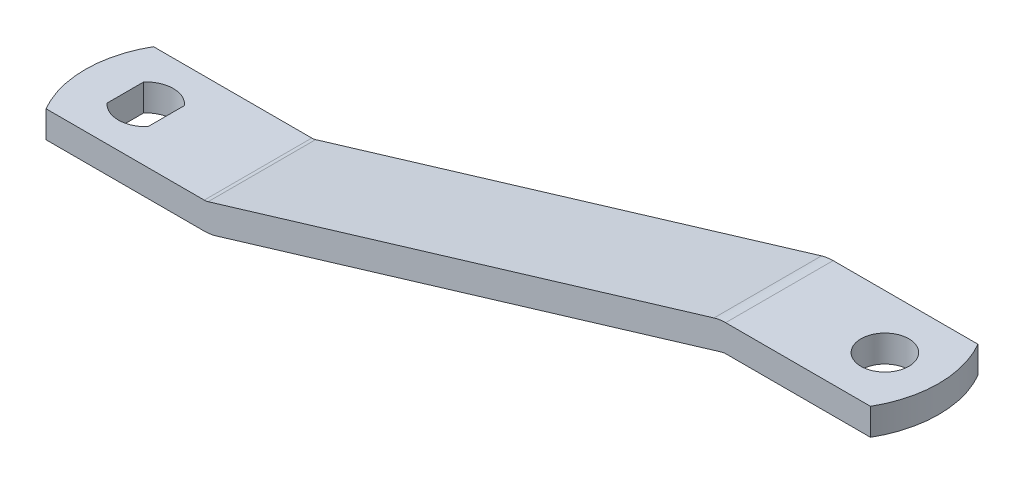
ISO-10303-21;
HEADER;
FILE_DESCRIPTION(('STEP AP214'),'2;1');
FILE_NAME('part.step','',(''),(''),'','','');
FILE_SCHEMA(('AUTOMOTIVE_DESIGN { 1 0 10303 214 1 1 1 1 }'));
ENDSEC;
DATA;
#1=APPLICATION_CONTEXT('core data for automotive mechanical design processes');
#2=APPLICATION_PROTOCOL_DEFINITION('international standard','automotive_design',2000,#1);
#3=PRODUCT_CONTEXT('',#1,'mechanical');
#4=PRODUCT('Part','Part','',(#3));
#5=PRODUCT_RELATED_PRODUCT_CATEGORY('part','',(#4));
#6=PRODUCT_DEFINITION_FORMATION('','',#4);
#7=PRODUCT_DEFINITION_CONTEXT('part definition',#1,'design');
#8=PRODUCT_DEFINITION('design','',#6,#7);
#9=PRODUCT_DEFINITION_SHAPE('','',#8);
#10=(LENGTH_UNIT() NAMED_UNIT(*) SI_UNIT(.MILLI.,.METRE.));
#11=(NAMED_UNIT(*) PLANE_ANGLE_UNIT() SI_UNIT($,.RADIAN.));
#12=(NAMED_UNIT(*) SI_UNIT($,.STERADIAN.) SOLID_ANGLE_UNIT());
#13=UNCERTAINTY_MEASURE_WITH_UNIT(LENGTH_MEASURE(1.E-05),#10,'distance_accuracy_value','');
#14=(GEOMETRIC_REPRESENTATION_CONTEXT(3) GLOBAL_UNCERTAINTY_ASSIGNED_CONTEXT((#13)) GLOBAL_UNIT_ASSIGNED_CONTEXT((#10,
#11,#12)) REPRESENTATION_CONTEXT('',''));
#15=CARTESIAN_POINT('',(0.,0.,0.));
#16=DIRECTION('',(0.,0.,1.));
#17=DIRECTION('',(1.,0.,0.));
#18=AXIS2_PLACEMENT_3D('',#15,#16,#17);
#19=CARTESIAN_POINT('',(163.979954734275,33.3375000000001,0.));
#20=DIRECTION('',(0.,0.,1.));
#21=DIRECTION('',(1.,0.,0.));
#22=AXIS2_PLACEMENT_3D('',#19,#20,#21);
#23=CYLINDRICAL_SURFACE('',#22,3.175);
#24=DIRECTION('',(0.,0.,1.));
#25=VECTOR('',#24,1.);
#26=CARTESIAN_POINT('',(163.064880976484,36.3777738392788,0.));
#27=LINE('',#26,#25);
#28=CARTESIAN_POINT('',(163.064880976484,36.3777738392788,-12.7));
#29=VERTEX_POINT('',#28);
#30=CARTESIAN_POINT('',(163.064880976484,36.3777738392788,12.7));
#31=VERTEX_POINT('',#30);
#32=EDGE_CURVE('E136',#29,#31,#27,.T.);
#33=ORIENTED_EDGE('',*,*,#32,.F.);
#34=CARTESIAN_POINT('',(163.979954734275,33.3375000000001,-12.7));
#35=DIRECTION('',(0.,0.,1.));
#36=DIRECTION('',(1.,0.,0.));
#37=AXIS2_PLACEMENT_3D('',#34,#35,#36);
#38=CIRCLE('',#37,3.175);
#39=CARTESIAN_POINT('',(163.979954734275,36.5125,-12.7));
#40=VERTEX_POINT('',#39);
#41=EDGE_CURVE('E20',#40,#29,#38,.T.);
#42=ORIENTED_EDGE('',*,*,#41,.F.);
#43=DIRECTION('',(0.,0.,-1.));
#44=VECTOR('',#43,1.);
#45=CARTESIAN_POINT('',(163.979954734275,36.5125,0.));
#46=LINE('',#45,#44);
#47=CARTESIAN_POINT('',(163.979954734275,36.5125,12.7));
#48=VERTEX_POINT('',#47);
#49=EDGE_CURVE('E140',#48,#40,#46,.T.);
#50=ORIENTED_EDGE('',*,*,#49,.F.);
#51=CARTESIAN_POINT('',(163.979954734275,33.3375000000001,12.7));
#52=DIRECTION('',(0.,0.,1.));
#53=DIRECTION('',(1.,0.,0.));
#54=AXIS2_PLACEMENT_3D('',#51,#52,#53);
#55=CIRCLE('',#54,3.175);
#56=EDGE_CURVE('E134',#31,#48,#55,.F.);
#57=ORIENTED_EDGE('',*,*,#56,.F.);
#58=EDGE_LOOP('',(#33,#42,#50,#57));
#59=FACE_BOUND('',#58,.T.);
#60=ADVANCED_FACE('F17',(#59),#23,.F.);
#61=CARTESIAN_POINT('',(188.9125,42.8625,0.));
#62=DIRECTION('',(0.,-1.,0.));
#63=DIRECTION('',(0.,0.,-1.));
#64=AXIS2_PLACEMENT_3D('',#61,#62,#63);
#65=CYLINDRICAL_SURFACE('',#64,5.6515);
#66=CARTESIAN_POINT('',(188.9125,42.8625,0.));
#67=DIRECTION('',(0.,-1.,0.));
#68=DIRECTION('',(0.,0.,-1.));
#69=AXIS2_PLACEMENT_3D('',#66,#67,#68);
#70=CIRCLE('',#69,5.6515);
#71=CARTESIAN_POINT('',(188.9125,42.8625,-5.6515));
#72=VERTEX_POINT('',#71);
#73=EDGE_CURVE('E244',#72,#72,#70,.T.);
#74=ORIENTED_EDGE('',*,*,#73,.F.);
#75=EDGE_LOOP('',(#74));
#76=FACE_BOUND('',#75,.T.);
#77=CARTESIAN_POINT('',(188.9125,36.5125,0.));
#78=DIRECTION('',(0.,-1.,0.));
#79=DIRECTION('',(0.,0.,-1.));
#80=AXIS2_PLACEMENT_3D('',#77,#78,#79);
#81=CIRCLE('',#80,5.6515);
#82=CARTESIAN_POINT('',(188.9125,36.5125,-5.6515));
#83=VERTEX_POINT('',#82);
#84=EDGE_CURVE('E202',#83,#83,#81,.F.);
#85=ORIENTED_EDGE('',*,*,#84,.F.);
#86=EDGE_LOOP('',(#85));
#87=FACE_BOUND('',#86,.T.);
#88=ADVANCED_FACE('F338',(#76,#87),#65,.F.);
#89=CARTESIAN_POINT('',(9.46150000000003,6.35000000000003,-4.31986724333053));
#90=DIRECTION('',(-1.,0.,0.));
#91=DIRECTION('',(0.,0.,1.));
#92=AXIS2_PLACEMENT_3D('',#89,#90,#91);
#93=PLANE('',#92);
#94=DIRECTION('',(0.,-1.,0.));
#95=VECTOR('',#94,1.);
#96=CARTESIAN_POINT('',(9.46150000000001,6.35000000000002,-4.31986724333054));
#97=LINE('',#96,#95);
#98=CARTESIAN_POINT('',(9.46150000000002,0.,-4.31986724333054));
#99=VERTEX_POINT('',#98);
#100=CARTESIAN_POINT('',(9.46150000000002,6.35000000000001,-4.31986724333054));
#101=VERTEX_POINT('',#100);
#102=EDGE_CURVE('E225',#99,#101,#97,.F.);
#103=ORIENTED_EDGE('',*,*,#102,.T.);
#104=DIRECTION('',(0.,0.,1.));
#105=VECTOR('',#104,1.);
#106=CARTESIAN_POINT('',(9.46150000000003,6.35,0.));
#107=LINE('',#106,#105);
#108=CARTESIAN_POINT('',(9.46150000000002,6.35000000000001,4.31986724333062));
#109=VERTEX_POINT('',#108);
#110=EDGE_CURVE('E190',#109,#101,#107,.F.);
#111=ORIENTED_EDGE('',*,*,#110,.F.);
#112=DIRECTION('',(0.,-1.,0.));
#113=VECTOR('',#112,1.);
#114=CARTESIAN_POINT('',(9.46150000000002,6.35000000000002,4.31986724333061));
#115=LINE('',#114,#113);
#116=CARTESIAN_POINT('',(9.46150000000003,0.,4.31986724333061));
#117=VERTEX_POINT('',#116);
#118=EDGE_CURVE('E215',#109,#117,#115,.T.);
#119=ORIENTED_EDGE('',*,*,#118,.T.);
#120=DIRECTION('',(0.,0.,-1.));
#121=VECTOR('',#120,1.);
#122=CARTESIAN_POINT('',(9.46150000000003,0.,0.));
#123=LINE('',#122,#121);
#124=EDGE_CURVE('E212',#99,#117,#123,.F.);
#125=ORIENTED_EDGE('',*,*,#124,.F.);
#126=EDGE_LOOP('',(#103,#111,#119,#125));
#127=FACE_BOUND('',#126,.T.);
#128=ADVANCED_FACE('F340',(#127),#93,.F.);
#129=CARTESIAN_POINT('',(14.2875,6.35000000000003,0.));
#130=DIRECTION('',(0.,-1.,0.));
#131=DIRECTION('',(1.,0.,0.));
#132=AXIS2_PLACEMENT_3D('',#129,#130,#131);
#133=CYLINDRICAL_SURFACE('',#132,6.477);
#134=DIRECTION('',(0.,1.,0.));
#135=VECTOR('',#134,1.);
#136=CARTESIAN_POINT('',(19.1135,6.35000000000003,-4.31986724333053));
#137=LINE('',#136,#135);
#138=CARTESIAN_POINT('',(19.1135,0.,-4.31986724333053));
#139=VERTEX_POINT('',#138);
#140=CARTESIAN_POINT('',(19.1135,6.35000000000002,-4.31986724333054));
#141=VERTEX_POINT('',#140);
#142=EDGE_CURVE('E222',#139,#141,#137,.T.);
#143=ORIENTED_EDGE('',*,*,#142,.T.);
#144=CARTESIAN_POINT('',(14.2875,6.35000000000003,0.));
#145=DIRECTION('',(0.,-1.,0.));
#146=DIRECTION('',(1.,0.,0.));
#147=AXIS2_PLACEMENT_3D('',#144,#145,#146);
#148=CIRCLE('',#147,6.477);
#149=EDGE_CURVE('E189',#101,#141,#148,.T.);
#150=ORIENTED_EDGE('',*,*,#149,.F.);
#151=ORIENTED_EDGE('',*,*,#102,.F.);
#152=CARTESIAN_POINT('',(14.2875,0.,0.));
#153=DIRECTION('',(0.,-1.,0.));
#154=DIRECTION('',(1.,0.,0.));
#155=AXIS2_PLACEMENT_3D('',#152,#153,#154);
#156=CIRCLE('',#155,6.477);
#157=EDGE_CURVE('E207',#139,#99,#156,.F.);
#158=ORIENTED_EDGE('',*,*,#157,.F.);
#159=EDGE_LOOP('',(#143,#150,#151,#158));
#160=FACE_BOUND('',#159,.T.);
#161=ADVANCED_FACE('F346',(#160),#133,.F.);
#162=CARTESIAN_POINT('',(19.1135,6.35000000000003,4.31986724333061));
#163=DIRECTION('',(1.,0.,0.));
#164=DIRECTION('',(0.,0.,-1.));
#165=AXIS2_PLACEMENT_3D('',#162,#163,#164);
#166=PLANE('',#165);
#167=DIRECTION('',(0.,-1.,0.));
#168=VECTOR('',#167,1.);
#169=CARTESIAN_POINT('',(19.1135,6.35000000000003,4.31986724333061));
#170=LINE('',#169,#168);
#171=CARTESIAN_POINT('',(19.1135,0.,4.3198672433306));
#172=VERTEX_POINT('',#171);
#173=CARTESIAN_POINT('',(19.1135,6.35000000000001,4.31986724333062));
#174=VERTEX_POINT('',#173);
#175=EDGE_CURVE('E220',#172,#174,#170,.F.);
#176=ORIENTED_EDGE('',*,*,#175,.T.);
#177=DIRECTION('',(0.,0.,1.));
#178=VECTOR('',#177,1.);
#179=CARTESIAN_POINT('',(19.1135,6.35,0.));
#180=LINE('',#179,#178);
#181=EDGE_CURVE('E185',#141,#174,#180,.T.);
#182=ORIENTED_EDGE('',*,*,#181,.F.);
#183=ORIENTED_EDGE('',*,*,#142,.F.);
#184=DIRECTION('',(0.,0.,-1.));
#185=VECTOR('',#184,1.);
#186=CARTESIAN_POINT('',(19.1135,0.,0.));
#187=LINE('',#186,#185);
#188=EDGE_CURVE('E208',#172,#139,#187,.T.);
#189=ORIENTED_EDGE('',*,*,#188,.F.);
#190=EDGE_LOOP('',(#176,#182,#183,#189));
#191=FACE_BOUND('',#190,.T.);
#192=ADVANCED_FACE('F353',(#191),#166,.F.);
#193=CARTESIAN_POINT('',(14.2875,6.35000000000003,0.));
#194=DIRECTION('',(0.,-1.,0.));
#195=DIRECTION('',(1.,0.,0.));
#196=AXIS2_PLACEMENT_3D('',#193,#194,#195);
#197=CYLINDRICAL_SURFACE('',#196,6.477);
#198=ORIENTED_EDGE('',*,*,#118,.F.);
#199=CARTESIAN_POINT('',(14.2875,6.35000000000002,0.));
#200=DIRECTION('',(0.,-1.,0.));
#201=DIRECTION('',(1.,0.,0.));
#202=AXIS2_PLACEMENT_3D('',#199,#200,#201);
#203=CIRCLE('',#202,6.477);
#204=EDGE_CURVE('E188',#174,#109,#203,.T.);
#205=ORIENTED_EDGE('',*,*,#204,.F.);
#206=ORIENTED_EDGE('',*,*,#175,.F.);
#207=CARTESIAN_POINT('',(14.2875,0.,0.));
#208=DIRECTION('',(0.,-1.,0.));
#209=DIRECTION('',(1.,0.,0.));
#210=AXIS2_PLACEMENT_3D('',#207,#208,#209);
#211=CIRCLE('',#210,6.477);
#212=EDGE_CURVE('E211',#117,#172,#211,.F.);
#213=ORIENTED_EDGE('',*,*,#212,.F.);
#214=EDGE_LOOP('',(#198,#205,#206,#213));
#215=FACE_BOUND('',#214,.T.);
#216=ADVANCED_FACE('F306',(#215),#197,.F.);
#217=CARTESIAN_POINT('',(40.7996975821438,0.,0.));
#218=DIRECTION('',(0.,-1.,0.));
#219=DIRECTION('',(0.,0.,-1.));
#220=AXIS2_PLACEMENT_3D('',#217,#218,#219);
#221=PLANE('',#220);
#222=ORIENTED_EDGE('',*,*,#188,.T.);
#223=ORIENTED_EDGE('',*,*,#157,.T.);
#224=ORIENTED_EDGE('',*,*,#124,.T.);
#225=ORIENTED_EDGE('',*,*,#212,.T.);
#226=EDGE_LOOP('',(#222,#223,#224,#225));
#227=FACE_BOUND('',#226,.T.);
#228=DIRECTION('',(0.,0.,1.));
#229=VECTOR('',#228,1.);
#230=CARTESIAN_POINT('',(40.7996975821438,0.,0.));
#231=LINE('',#230,#229);
#232=CARTESIAN_POINT('',(40.7996975821438,0.,12.7));
#233=VERTEX_POINT('',#232);
#234=CARTESIAN_POINT('',(40.7996975821438,0.,-12.7));
#235=VERTEX_POINT('',#234);
#236=EDGE_CURVE('E203',#233,#235,#231,.F.);
#237=ORIENTED_EDGE('',*,*,#236,.F.);
#238=DIRECTION('',(1.,0.,0.));
#239=VECTOR('',#238,1.);
#240=CARTESIAN_POINT('',(100.845960157171,0.,12.7));
#241=LINE('',#240,#239);
#242=CARTESIAN_POINT('',(3.40295474387525,0.,12.7));
#243=VERTEX_POINT('',#242);
#244=EDGE_CURVE('E177',#243,#233,#241,.T.);
#245=ORIENTED_EDGE('',*,*,#244,.F.);
#246=CARTESIAN_POINT('',(25.4,0.,0.));
#247=DIRECTION('',(0.,-1.,0.));
#248=DIRECTION('',(1.,0.,0.));
#249=AXIS2_PLACEMENT_3D('',#246,#247,#248);
#250=CIRCLE('',#249,25.4);
#251=CARTESIAN_POINT('',(3.40295474387526,0.,-12.7));
#252=VERTEX_POINT('',#251);
#253=EDGE_CURVE('E242',#252,#243,#250,.F.);
#254=ORIENTED_EDGE('',*,*,#253,.F.);
#255=DIRECTION('',(1.,0.,0.));
#256=VECTOR('',#255,1.);
#257=CARTESIAN_POINT('',(100.845960157171,0.,-12.7));
#258=LINE('',#257,#256);
#259=EDGE_CURVE('E149',#252,#235,#258,.T.);
#260=ORIENTED_EDGE('',*,*,#259,.T.);
#261=EDGE_LOOP('',(#237,#245,#254,#260));
#262=FACE_BOUND('',#261,.T.);
#263=ADVANCED_FACE('F295',(#227,#262),#221,.T.);
#264=CARTESIAN_POINT('',(40.7996975821438,9.52500000000005,0.));
#265=DIRECTION('',(0.,0.,1.));
#266=DIRECTION('',(1.,0.,0.));
#267=AXIS2_PLACEMENT_3D('',#264,#265,#266);
#268=CYLINDRICAL_SURFACE('',#267,9.525);
#269=CARTESIAN_POINT('',(40.7996975821438,9.52500000000005,-12.7));
#270=DIRECTION('',(0.,0.,1.));
#271=DIRECTION('',(1.,0.,0.));
#272=AXIS2_PLACEMENT_3D('',#269,#270,#271);
#273=CIRCLE('',#272,9.525);
#274=CARTESIAN_POINT('',(43.5449188555159,0.404178482163768,-12.7));
#275=VERTEX_POINT('',#274);
#276=EDGE_CURVE('E145',#235,#275,#273,.T.);
#277=ORIENTED_EDGE('',*,*,#276,.T.);
#278=DIRECTION('',(0.,0.,1.));
#279=VECTOR('',#278,1.);
#280=CARTESIAN_POINT('',(43.5449188555159,0.404178482163772,0.));
#281=LINE('',#280,#279);
#282=CARTESIAN_POINT('',(43.5449188555159,0.404178482163768,12.7));
#283=VERTEX_POINT('',#282);
#284=EDGE_CURVE('E141',#283,#275,#281,.F.);
#285=ORIENTED_EDGE('',*,*,#284,.F.);
#286=CARTESIAN_POINT('',(40.7996975821438,9.52500000000005,12.7));
#287=DIRECTION('',(0.,0.,1.));
#288=DIRECTION('',(1.,0.,0.));
#289=AXIS2_PLACEMENT_3D('',#286,#287,#288);
#290=CIRCLE('',#289,9.525);
#291=EDGE_CURVE('E176',#233,#283,#290,.T.);
#292=ORIENTED_EDGE('',*,*,#291,.F.);
#293=ORIENTED_EDGE('',*,*,#236,.T.);
#294=EDGE_LOOP('',(#277,#285,#292,#293));
#295=FACE_BOUND('',#294,.T.);
#296=ADVANCED_FACE('F297',(#295),#268,.T.);
#297=CARTESIAN_POINT('',(163.064880976484,36.3777738392788,0.));
#298=DIRECTION('',(0.288212207178174,-0.957566563552365,0.));
#299=DIRECTION('',(0.957566563552365,0.288212207178174,0.));
#300=AXIS2_PLACEMENT_3D('',#297,#298,#299);
#301=PLANE('',#300);
#302=DIRECTION('',(0.957566563552365,0.288212207178174,0.));
#303=VECTOR('',#302,1.);
#304=CARTESIAN_POINT('',(43.5449188555159,0.404178482163745,-12.7));
#305=LINE('',#304,#303);
#306=EDGE_CURVE('E131',#275,#29,#305,.T.);
#307=ORIENTED_EDGE('',*,*,#306,.T.);
#308=ORIENTED_EDGE('',*,*,#32,.T.);
#309=DIRECTION('',(0.957566563552365,0.288212207178174,0.));
#310=VECTOR('',#309,1.);
#311=CARTESIAN_POINT('',(43.5449188555159,0.404178482163745,12.7));
#312=LINE('',#311,#310);
#313=EDGE_CURVE('E174',#283,#31,#312,.T.);
#314=ORIENTED_EDGE('',*,*,#313,.F.);
#315=ORIENTED_EDGE('',*,*,#284,.T.);
#316=EDGE_LOOP('',(#307,#308,#314,#315));
#317=FACE_BOUND('',#316,.T.);
#318=ADVANCED_FACE('F144',(#317),#301,.T.);
#319=CARTESIAN_POINT('',(201.6125,36.5125,0.));
#320=DIRECTION('',(0.,-1.,0.));
#321=DIRECTION('',(0.,0.,-1.));
#322=AXIS2_PLACEMENT_3D('',#319,#320,#321);
#323=PLANE('',#322);
#324=ORIENTED_EDGE('',*,*,#84,.T.);
#325=EDGE_LOOP('',(#324));
#326=FACE_BOUND('',#325,.T.);
#327=ORIENTED_EDGE('',*,*,#49,.T.);
#328=DIRECTION('',(1.,0.,0.));
#329=VECTOR('',#328,1.);
#330=CARTESIAN_POINT('',(100.845960157171,36.5125000000001,-12.7));
#331=LINE('',#330,#329);
#332=CARTESIAN_POINT('',(198.209545256125,36.5125,-12.7));
#333=VERTEX_POINT('',#332);
#334=EDGE_CURVE('E133',#40,#333,#331,.T.);
#335=ORIENTED_EDGE('',*,*,#334,.T.);
#336=CARTESIAN_POINT('',(176.2125,36.5125,0.));
#337=DIRECTION('',(0.,-1.,0.));
#338=DIRECTION('',(0.,0.,-1.));
#339=AXIS2_PLACEMENT_3D('',#336,#337,#338);
#340=CIRCLE('',#339,25.4);
#341=CARTESIAN_POINT('',(198.209545256125,36.5125,12.7));
#342=VERTEX_POINT('',#341);
#343=EDGE_CURVE('E250',#342,#333,#340,.F.);
#344=ORIENTED_EDGE('',*,*,#343,.F.);
#345=DIRECTION('',(1.,0.,0.));
#346=VECTOR('',#345,1.);
#347=CARTESIAN_POINT('',(100.845960157171,36.5125000000001,12.7));
#348=LINE('',#347,#346);
#349=EDGE_CURVE('E171',#48,#342,#348,.T.);
#350=ORIENTED_EDGE('',*,*,#349,.F.);
#351=EDGE_LOOP('',(#327,#335,#344,#350));
#352=FACE_BOUND('',#351,.T.);
#353=ADVANCED_FACE('F262',(#326,#352),#323,.T.);
#354=CARTESIAN_POINT('',(176.2125,42.8625,0.));
#355=DIRECTION('',(0.,-1.,0.));
#356=DIRECTION('',(0.,0.,-1.));
#357=AXIS2_PLACEMENT_3D('',#354,#355,#356);
#358=CYLINDRICAL_SURFACE('',#357,25.4);
#359=CARTESIAN_POINT('',(176.2125,42.8625,0.));
#360=DIRECTION('',(0.,-1.,0.));
#361=DIRECTION('',(0.,0.,-1.));
#362=AXIS2_PLACEMENT_3D('',#359,#360,#361);
#363=CIRCLE('',#362,25.4);
#364=CARTESIAN_POINT('',(198.209545256125,42.8625,12.7));
#365=VERTEX_POINT('',#364);
#366=CARTESIAN_POINT('',(198.209545256125,42.8625,-12.7));
#367=VERTEX_POINT('',#366);
#368=EDGE_CURVE('E247',#365,#367,#363,.F.);
#369=ORIENTED_EDGE('',*,*,#368,.F.);
#370=DIRECTION('',(0.,1.,0.));
#371=VECTOR('',#370,1.);
#372=CARTESIAN_POINT('',(198.209545256125,21.1601895570696,12.7));
#373=LINE('',#372,#371);
#374=EDGE_CURVE('E170',#342,#365,#373,.T.);
#375=ORIENTED_EDGE('',*,*,#374,.F.);
#376=ORIENTED_EDGE('',*,*,#343,.T.);
#377=DIRECTION('',(0.,1.,0.));
#378=VECTOR('',#377,1.);
#379=CARTESIAN_POINT('',(198.209545256125,21.1601895570696,-12.7));
#380=LINE('',#379,#378);
#381=EDGE_CURVE('E147',#333,#367,#380,.T.);
#382=ORIENTED_EDGE('',*,*,#381,.T.);
#383=EDGE_LOOP('',(#369,#375,#376,#382));
#384=FACE_BOUND('',#383,.T.);
#385=ADVANCED_FACE('F265',(#384),#358,.T.);
#386=CARTESIAN_POINT('',(163.979954734275,42.8625,0.));
#387=DIRECTION('',(0.,1.,0.));
#388=DIRECTION('',(0.,0.,1.));
#389=AXIS2_PLACEMENT_3D('',#386,#387,#388);
#390=PLANE('',#389);
#391=ORIENTED_EDGE('',*,*,#73,.T.);
#392=EDGE_LOOP('',(#391));
#393=FACE_BOUND('',#392,.T.);
#394=DIRECTION('',(0.,0.,1.));
#395=VECTOR('',#394,1.);
#396=CARTESIAN_POINT('',(163.979954734275,42.8625,0.));
#397=LINE('',#396,#395);
#398=CARTESIAN_POINT('',(163.979954734275,42.8625,12.7));
#399=VERTEX_POINT('',#398);
#400=CARTESIAN_POINT('',(163.979954734275,42.8625,-12.7));
#401=VERTEX_POINT('',#400);
#402=EDGE_CURVE('E154',#399,#401,#397,.F.);
#403=ORIENTED_EDGE('',*,*,#402,.F.);
#404=DIRECTION('',(1.,0.,0.));
#405=VECTOR('',#404,1.);
#406=CARTESIAN_POINT('',(100.845960157171,42.8625,12.7));
#407=LINE('',#406,#405);
#408=EDGE_CURVE('E168',#365,#399,#407,.F.);
#409=ORIENTED_EDGE('',*,*,#408,.F.);
#410=ORIENTED_EDGE('',*,*,#368,.T.);
#411=DIRECTION('',(1.,0.,0.));
#412=VECTOR('',#411,1.);
#413=CARTESIAN_POINT('',(100.845960157171,42.8625,-12.7));
#414=LINE('',#413,#412);
#415=EDGE_CURVE('E200',#367,#401,#414,.F.);
#416=ORIENTED_EDGE('',*,*,#415,.T.);
#417=EDGE_LOOP('',(#403,#409,#410,#416));
#418=FACE_BOUND('',#417,.T.);
#419=ADVANCED_FACE('F271',(#393,#418),#390,.T.);
#420=CARTESIAN_POINT('',(25.4,6.35000000000003,0.));
#421=DIRECTION('',(0.,-1.,0.));
#422=DIRECTION('',(1.,0.,0.));
#423=AXIS2_PLACEMENT_3D('',#420,#421,#422);
#424=CYLINDRICAL_SURFACE('',#423,25.4);
#425=CARTESIAN_POINT('',(25.4,6.35000000000002,0.));
#426=DIRECTION('',(0.,-1.,0.));
#427=DIRECTION('',(1.,0.,0.));
#428=AXIS2_PLACEMENT_3D('',#425,#426,#427);
#429=CIRCLE('',#428,25.4);
#430=CARTESIAN_POINT('',(3.40295474387525,6.35000000000003,-12.7));
#431=VERTEX_POINT('',#430);
#432=CARTESIAN_POINT('',(3.40295474387525,6.35000000000003,12.7));
#433=VERTEX_POINT('',#432);
#434=EDGE_CURVE('E193',#431,#433,#429,.F.);
#435=ORIENTED_EDGE('',*,*,#434,.F.);
#436=DIRECTION('',(0.,1.,0.));
#437=VECTOR('',#436,1.);
#438=CARTESIAN_POINT('',(3.40295474387525,21.1601895570696,-12.7));
#439=LINE('',#438,#437);
#440=EDGE_CURVE('E184',#431,#252,#439,.F.);
#441=ORIENTED_EDGE('',*,*,#440,.T.);
#442=ORIENTED_EDGE('',*,*,#253,.T.);
#443=DIRECTION('',(0.,1.,0.));
#444=VECTOR('',#443,1.);
#445=CARTESIAN_POINT('',(3.40295474387525,21.1601895570696,12.7));
#446=LINE('',#445,#444);
#447=EDGE_CURVE('E180',#433,#243,#446,.F.);
#448=ORIENTED_EDGE('',*,*,#447,.F.);
#449=EDGE_LOOP('',(#435,#441,#442,#448));
#450=FACE_BOUND('',#449,.T.);
#451=ADVANCED_FACE('F291',(#450),#424,.T.);
#452=CARTESIAN_POINT('',(0.,6.35,0.));
#453=DIRECTION('',(0.,1.,0.));
#454=DIRECTION('',(0.,0.,1.));
#455=AXIS2_PLACEMENT_3D('',#452,#453,#454);
#456=PLANE('',#455);
#457=ORIENTED_EDGE('',*,*,#181,.T.);
#458=ORIENTED_EDGE('',*,*,#204,.T.);
#459=ORIENTED_EDGE('',*,*,#110,.T.);
#460=ORIENTED_EDGE('',*,*,#149,.T.);
#461=EDGE_LOOP('',(#457,#458,#459,#460));
#462=FACE_BOUND('',#461,.T.);
#463=DIRECTION('',(0.,0.,1.));
#464=VECTOR('',#463,1.);
#465=CARTESIAN_POINT('',(40.7996975821438,6.35000000000005,0.));
#466=LINE('',#465,#464);
#467=CARTESIAN_POINT('',(40.7996975821438,6.35000000000005,12.7));
#468=VERTEX_POINT('',#467);
#469=CARTESIAN_POINT('',(40.7996975821438,6.35000000000005,-12.7));
#470=VERTEX_POINT('',#469);
#471=EDGE_CURVE('E181',#468,#470,#466,.F.);
#472=ORIENTED_EDGE('',*,*,#471,.T.);
#473=DIRECTION('',(1.,0.,0.));
#474=VECTOR('',#473,1.);
#475=CARTESIAN_POINT('',(100.845960157171,6.35000000000005,-12.7));
#476=LINE('',#475,#474);
#477=EDGE_CURVE('E196',#470,#431,#476,.F.);
#478=ORIENTED_EDGE('',*,*,#477,.T.);
#479=ORIENTED_EDGE('',*,*,#434,.T.);
#480=DIRECTION('',(1.,0.,0.));
#481=VECTOR('',#480,1.);
#482=CARTESIAN_POINT('',(100.845960157171,6.35000000000005,12.7));
#483=LINE('',#482,#481);
#484=EDGE_CURVE('E164',#468,#433,#483,.F.);
#485=ORIENTED_EDGE('',*,*,#484,.F.);
#486=EDGE_LOOP('',(#472,#478,#479,#485));
#487=FACE_BOUND('',#486,.T.);
#488=ADVANCED_FACE('F286',(#462,#487),#456,.T.);
#489=CARTESIAN_POINT('',(100.845960157171,21.1601895570696,12.7));
#490=DIRECTION('',(0.,0.,1.));
#491=DIRECTION('',(1.,0.,0.));
#492=AXIS2_PLACEMENT_3D('',#489,#490,#491);
#493=PLANE('',#492);
#494=CARTESIAN_POINT('',(40.7996975821438,9.52500000000005,12.7));
#495=DIRECTION('',(0.,0.,1.));
#496=DIRECTION('',(1.,0.,0.));
#497=AXIS2_PLACEMENT_3D('',#494,#495,#496);
#498=CIRCLE('',#497,3.175);
#499=CARTESIAN_POINT('',(41.7147713399345,6.48472616072128,12.7));
#500=VERTEX_POINT('',#499);
#501=EDGE_CURVE('E163',#500,#468,#498,.F.);
#502=ORIENTED_EDGE('',*,*,#501,.T.);
#503=ORIENTED_EDGE('',*,*,#484,.T.);
#504=ORIENTED_EDGE('',*,*,#447,.T.);
#505=ORIENTED_EDGE('',*,*,#244,.T.);
#506=ORIENTED_EDGE('',*,*,#291,.T.);
#507=ORIENTED_EDGE('',*,*,#313,.T.);
#508=ORIENTED_EDGE('',*,*,#56,.T.);
#509=ORIENTED_EDGE('',*,*,#349,.T.);
#510=ORIENTED_EDGE('',*,*,#374,.T.);
#511=ORIENTED_EDGE('',*,*,#408,.T.);
#512=CARTESIAN_POINT('',(163.979954734275,33.3375,12.7));
#513=DIRECTION('',(0.,0.,1.));
#514=DIRECTION('',(1.,0.,0.));
#515=AXIS2_PLACEMENT_3D('',#512,#513,#514);
#516=CIRCLE('',#515,9.525);
#517=CARTESIAN_POINT('',(161.234733460903,42.4583215178362,12.7));
#518=VERTEX_POINT('',#517);
#519=EDGE_CURVE('E167',#518,#399,#516,.F.);
#520=ORIENTED_EDGE('',*,*,#519,.F.);
#521=DIRECTION('',(-0.957566563552365,-0.288212207178172,0.));
#522=VECTOR('',#521,1.);
#523=CARTESIAN_POINT('',(41.7147713399345,6.48472616072128,12.7));
#524=LINE('',#523,#522);
#525=EDGE_CURVE('E158',#500,#518,#524,.F.);
#526=ORIENTED_EDGE('',*,*,#525,.F.);
#527=EDGE_LOOP('',(#502,#503,#504,#505,#506,#507,#508,#509,#510,#511,#520,#526));
#528=FACE_BOUND('',#527,.T.);
#529=ADVANCED_FACE('F259',(#528),#493,.T.);
#530=CARTESIAN_POINT('',(163.979954734275,33.3375,0.));
#531=DIRECTION('',(0.,0.,1.));
#532=DIRECTION('',(1.,0.,0.));
#533=AXIS2_PLACEMENT_3D('',#530,#531,#532);
#534=CYLINDRICAL_SURFACE('',#533,9.525);
#535=CARTESIAN_POINT('',(163.979954734275,33.3375,-12.7));
#536=DIRECTION('',(0.,0.,1.));
#537=DIRECTION('',(1.,0.,0.));
#538=AXIS2_PLACEMENT_3D('',#535,#536,#537);
#539=CIRCLE('',#538,9.525);
#540=CARTESIAN_POINT('',(161.234733460903,42.4583215178362,-12.7));
#541=VERTEX_POINT('',#540);
#542=EDGE_CURVE('E230',#401,#541,#539,.T.);
#543=ORIENTED_EDGE('',*,*,#542,.T.);
#544=DIRECTION('',(0.,0.,1.));
#545=VECTOR('',#544,1.);
#546=CARTESIAN_POINT('',(161.234733460903,42.4583215178363,0.));
#547=LINE('',#546,#545);
#548=EDGE_CURVE('E155',#518,#541,#547,.F.);
#549=ORIENTED_EDGE('',*,*,#548,.F.);
#550=ORIENTED_EDGE('',*,*,#519,.T.);
#551=ORIENTED_EDGE('',*,*,#402,.T.);
#552=EDGE_LOOP('',(#543,#549,#550,#551));
#553=FACE_BOUND('',#552,.T.);
#554=ADVANCED_FACE('F275',(#553),#534,.T.);
#555=CARTESIAN_POINT('',(100.845960157171,21.1601895570696,-12.7));
#556=DIRECTION('',(0.,0.,1.));
#557=DIRECTION('',(1.,0.,0.));
#558=AXIS2_PLACEMENT_3D('',#555,#556,#557);
#559=PLANE('',#558);
#560=ORIENTED_EDGE('',*,*,#477,.F.);
#561=CARTESIAN_POINT('',(40.7996975821438,9.52500000000005,-12.7));
#562=DIRECTION('',(0.,0.,1.));
#563=DIRECTION('',(1.,0.,0.));
#564=AXIS2_PLACEMENT_3D('',#561,#562,#563);
#565=CIRCLE('',#564,3.175);
#566=CARTESIAN_POINT('',(41.7147713399345,6.48472616072128,-12.7));
#567=VERTEX_POINT('',#566);
#568=EDGE_CURVE('E35',#470,#567,#565,.T.);
#569=ORIENTED_EDGE('',*,*,#568,.T.);
#570=DIRECTION('',(-0.957566563552365,-0.288212207178172,0.));
#571=VECTOR('',#570,1.);
#572=CARTESIAN_POINT('',(41.7147713399345,6.48472616072128,-12.7));
#573=LINE('',#572,#571);
#574=EDGE_CURVE('E26',#541,#567,#573,.T.);
#575=ORIENTED_EDGE('',*,*,#574,.F.);
#576=ORIENTED_EDGE('',*,*,#542,.F.);
#577=ORIENTED_EDGE('',*,*,#415,.F.);
#578=ORIENTED_EDGE('',*,*,#381,.F.);
#579=ORIENTED_EDGE('',*,*,#334,.F.);
#580=ORIENTED_EDGE('',*,*,#41,.T.);
#581=ORIENTED_EDGE('',*,*,#306,.F.);
#582=ORIENTED_EDGE('',*,*,#276,.F.);
#583=ORIENTED_EDGE('',*,*,#259,.F.);
#584=ORIENTED_EDGE('',*,*,#440,.F.);
#585=EDGE_LOOP('',(#560,#569,#575,#576,#577,#578,#579,#580,#581,#582,#583,#584));
#586=FACE_BOUND('',#585,.T.);
#587=ADVANCED_FACE('F128',(#586),#559,.F.);
#588=CARTESIAN_POINT('',(40.7996975821438,9.52500000000005,0.));
#589=DIRECTION('',(0.,0.,1.));
#590=DIRECTION('',(1.,0.,0.));
#591=AXIS2_PLACEMENT_3D('',#588,#589,#590);
#592=CYLINDRICAL_SURFACE('',#591,3.175);
#593=DIRECTION('',(0.,0.,1.));
#594=VECTOR('',#593,1.);
#595=CARTESIAN_POINT('',(41.7147713399345,6.48472616072128,0.));
#596=LINE('',#595,#594);
#597=EDGE_CURVE('E11',#567,#500,#596,.T.);
#598=ORIENTED_EDGE('',*,*,#597,.F.);
#599=ORIENTED_EDGE('',*,*,#568,.F.);
#600=ORIENTED_EDGE('',*,*,#471,.F.);
#601=ORIENTED_EDGE('',*,*,#501,.F.);
#602=EDGE_LOOP('',(#598,#599,#600,#601));
#603=FACE_BOUND('',#602,.T.);
#604=ADVANCED_FACE('F282',(#603),#592,.F.);
#605=CARTESIAN_POINT('',(41.7147713399345,6.48472616072128,0.));
#606=DIRECTION('',(-0.288212207178172,0.957566563552365,0.));
#607=DIRECTION('',(-0.957566563552365,-0.288212207178172,0.));
#608=AXIS2_PLACEMENT_3D('',#605,#606,#607);
#609=PLANE('',#608);
#610=ORIENTED_EDGE('',*,*,#574,.T.);
#611=ORIENTED_EDGE('',*,*,#597,.T.);
#612=ORIENTED_EDGE('',*,*,#525,.T.);
#613=ORIENTED_EDGE('',*,*,#548,.T.);
#614=EDGE_LOOP('',(#610,#611,#612,#613));
#615=FACE_BOUND('',#614,.T.);
#616=ADVANCED_FACE('F277',(#615),#609,.T.);
#617=CLOSED_SHELL('',(#60,#88,#128,#161,#192,#216,#263,#296,#318,#353,#385,#419,#451,#488,#529,
#554,#587,#604,#616));
#618=MANIFOLD_SOLID_BREP('B1',#617);
#619=ADVANCED_BREP_SHAPE_REPRESENTATION('',(#18,#618),#14);
#620=SHAPE_DEFINITION_REPRESENTATION(#9,#619);
ENDSEC;
END-ISO-10303-21;
